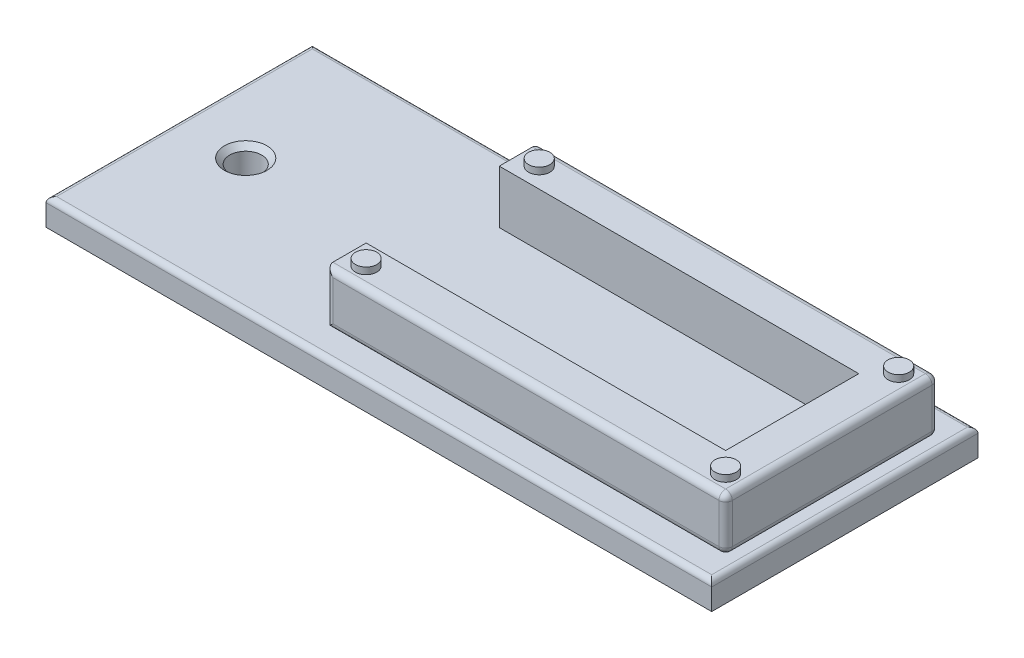
ISO-10303-21;
HEADER;
FILE_DESCRIPTION(('STEP AP214'),'2;1');
FILE_NAME('part.step','',(''),(''),'','','');
FILE_SCHEMA(('AUTOMOTIVE_DESIGN { 1 0 10303 214 1 1 1 1 }'));
ENDSEC;
DATA;
#1=APPLICATION_CONTEXT('core data for automotive mechanical design processes');
#2=APPLICATION_PROTOCOL_DEFINITION('international standard','automotive_design',2000,#1);
#3=PRODUCT_CONTEXT('',#1,'mechanical');
#4=PRODUCT('Part','Part','',(#3));
#5=PRODUCT_RELATED_PRODUCT_CATEGORY('part','',(#4));
#6=PRODUCT_DEFINITION_FORMATION('','',#4);
#7=PRODUCT_DEFINITION_CONTEXT('part definition',#1,'design');
#8=PRODUCT_DEFINITION('design','',#6,#7);
#9=PRODUCT_DEFINITION_SHAPE('','',#8);
#10=(LENGTH_UNIT() NAMED_UNIT(*) SI_UNIT(.MILLI.,.METRE.));
#11=(NAMED_UNIT(*) PLANE_ANGLE_UNIT() SI_UNIT($,.RADIAN.));
#12=(NAMED_UNIT(*) SI_UNIT($,.STERADIAN.) SOLID_ANGLE_UNIT());
#13=UNCERTAINTY_MEASURE_WITH_UNIT(LENGTH_MEASURE(1.E-05),#10,'distance_accuracy_value','');
#14=(GEOMETRIC_REPRESENTATION_CONTEXT(3) GLOBAL_UNCERTAINTY_ASSIGNED_CONTEXT((#13)) GLOBAL_UNIT_ASSIGNED_CONTEXT((#10,
#11,#12)) REPRESENTATION_CONTEXT('',''));
#15=CARTESIAN_POINT('',(0.,0.,0.));
#16=DIRECTION('',(0.,0.,1.));
#17=DIRECTION('',(1.,0.,0.));
#18=AXIS2_PLACEMENT_3D('',#15,#16,#17);
#19=CARTESIAN_POINT('',(69.7601340426178,108.703186723806,159.950463688265));
#20=DIRECTION('',(0.,1.,0.));
#21=DIRECTION('',(0.,0.,1.));
#22=AXIS2_PLACEMENT_3D('',#19,#20,#21);
#23=PLANE('',#22);
#24=DIRECTION('',(-1.,0.,0.));
#25=VECTOR('',#24,1.);
#26=CARTESIAN_POINT('',(-55.2398659573823,108.703186723806,111.950463688265));
#27=LINE('',#26,#25);
#28=CARTESIAN_POINT('',(192.760134042618,108.703186723806,111.950463688265));
#29=VERTEX_POINT('',#28);
#30=CARTESIAN_POINT('',(-53.2398659573823,108.703186723806,111.950463688265));
#31=VERTEX_POINT('',#30);
#32=EDGE_CURVE('E324',#29,#31,#27,.T.);
#33=ORIENTED_EDGE('',*,*,#32,.T.);
#34=DIRECTION('',(0.,0.,1.));
#35=VECTOR('',#34,1.);
#36=CARTESIAN_POINT('',(-53.2398659573823,108.703186723806,209.950463688265));
#37=LINE('',#36,#35);
#38=CARTESIAN_POINT('',(-53.2398659573823,108.703186723806,207.950463688265));
#39=VERTEX_POINT('',#38);
#40=EDGE_CURVE('E326',#31,#39,#37,.T.);
#41=ORIENTED_EDGE('',*,*,#40,.T.);
#42=DIRECTION('',(1.,0.,0.));
#43=VECTOR('',#42,1.);
#44=CARTESIAN_POINT('',(194.760134042618,108.703186723806,207.950463688265));
#45=LINE('',#44,#43);
#46=CARTESIAN_POINT('',(192.760134042618,108.703186723806,207.950463688265));
#47=VERTEX_POINT('',#46);
#48=EDGE_CURVE('E320',#39,#47,#45,.T.);
#49=ORIENTED_EDGE('',*,*,#48,.T.);
#50=DIRECTION('',(0.,0.,-1.));
#51=VECTOR('',#50,1.);
#52=CARTESIAN_POINT('',(192.760134042618,108.703186723806,109.950463688265));
#53=LINE('',#52,#51);
#54=EDGE_CURVE('E322',#47,#29,#53,.T.);
#55=ORIENTED_EDGE('',*,*,#54,.T.);
#56=EDGE_LOOP('',(#33,#41,#49,#55));
#57=FACE_BOUND('',#56,.T.);
#58=CARTESIAN_POINT('',(-30.2398659573823,108.703186723806,159.950463688265));
#59=DIRECTION('',(0.,1.,0.));
#60=DIRECTION('',(0.,0.,1.));
#61=AXIS2_PLACEMENT_3D('',#58,#59,#60);
#62=CIRCLE('',#61,8.00000000000001);
#63=CARTESIAN_POINT('',(-30.2398659573823,108.703186723806,167.950463688265));
#64=VERTEX_POINT('',#63);
#65=EDGE_CURVE('E11',#64,#64,#62,.F.);
#66=ORIENTED_EDGE('',*,*,#65,.T.);
#67=EDGE_LOOP('',(#66));
#68=FACE_BOUND('',#67,.T.);
#69=DIRECTION('',(0.,0.,-1.));
#70=VECTOR('',#69,1.);
#71=CARTESIAN_POINT('',(187.483980416502,108.703186723806,159.950463688265));
#72=LINE('',#71,#70);
#73=CARTESIAN_POINT('',(187.483980416502,108.703186723806,122.450463688265));
#74=VERTEX_POINT('',#73);
#75=CARTESIAN_POINT('',(187.483980416502,108.703186723806,197.450463688265));
#76=VERTEX_POINT('',#75);
#77=EDGE_CURVE('E224',#74,#76,#72,.F.);
#78=ORIENTED_EDGE('',*,*,#77,.T.);
#79=DIRECTION('',(1.,0.,0.));
#80=VECTOR('',#79,1.);
#81=CARTESIAN_POINT('',(174.983980416502,108.703186723806,197.450463688265));
#82=LINE('',#81,#80);
#83=CARTESIAN_POINT('',(39.9839804165022,108.703186723806,197.450463688265));
#84=VERTEX_POINT('',#83);
#85=EDGE_CURVE('E221',#76,#84,#82,.F.);
#86=ORIENTED_EDGE('',*,*,#85,.T.);
#87=DIRECTION('',(0.,0.,1.));
#88=VECTOR('',#87,1.);
#89=CARTESIAN_POINT('',(39.9839804165022,108.703186723806,184.950463688265));
#90=LINE('',#89,#88);
#91=CARTESIAN_POINT('',(39.9839804165022,108.703186723806,184.950463688265));
#92=VERTEX_POINT('',#91);
#93=EDGE_CURVE('E185',#92,#84,#90,.T.);
#94=ORIENTED_EDGE('',*,*,#93,.F.);
#95=DIRECTION('',(-1.,0.,0.));
#96=VECTOR('',#95,1.);
#97=CARTESIAN_POINT('',(174.983980416502,108.703186723806,184.950463688265));
#98=LINE('',#97,#96);
#99=CARTESIAN_POINT('',(174.983980416502,108.703186723806,184.950463688265));
#100=VERTEX_POINT('',#99);
#101=EDGE_CURVE('E834',#100,#92,#98,.T.);
#102=ORIENTED_EDGE('',*,*,#101,.F.);
#103=DIRECTION('',(0.,0.,1.));
#104=VECTOR('',#103,1.);
#105=CARTESIAN_POINT('',(174.983980416502,108.703186723806,184.950463688265));
#106=LINE('',#105,#104);
#107=CARTESIAN_POINT('',(174.983980416502,108.703186723806,134.950463688265));
#108=VERTEX_POINT('',#107);
#109=EDGE_CURVE('E832',#108,#100,#106,.T.);
#110=ORIENTED_EDGE('',*,*,#109,.F.);
#111=DIRECTION('',(1.,0.,0.));
#112=VECTOR('',#111,1.);
#113=CARTESIAN_POINT('',(174.983980416502,108.703186723806,134.950463688265));
#114=LINE('',#113,#112);
#115=CARTESIAN_POINT('',(39.9839804165022,108.703186723806,134.950463688265));
#116=VERTEX_POINT('',#115);
#117=EDGE_CURVE('E830',#116,#108,#114,.T.);
#118=ORIENTED_EDGE('',*,*,#117,.F.);
#119=DIRECTION('',(0.,0.,1.));
#120=VECTOR('',#119,1.);
#121=CARTESIAN_POINT('',(39.9839804165022,108.703186723806,134.950463688265));
#122=LINE('',#121,#120);
#123=CARTESIAN_POINT('',(39.9839804165022,108.703186723806,122.450463688265));
#124=VERTEX_POINT('',#123);
#125=EDGE_CURVE('E199',#124,#116,#122,.T.);
#126=ORIENTED_EDGE('',*,*,#125,.F.);
#127=DIRECTION('',(-1.,0.,0.));
#128=VECTOR('',#127,1.);
#129=CARTESIAN_POINT('',(174.983980416502,108.703186723806,122.450463688265));
#130=LINE('',#129,#128);
#131=EDGE_CURVE('E227',#124,#74,#130,.F.);
#132=ORIENTED_EDGE('',*,*,#131,.T.);
#133=EDGE_LOOP('',(#78,#86,#94,#102,#110,#118,#126,#132));
#134=FACE_BOUND('',#133,.T.);
#135=ADVANCED_FACE('F36',(#57,#68,#134),#23,.T.);
#136=CARTESIAN_POINT('',(-55.2398659573823,108.703186723806,209.950463688265));
#137=DIRECTION('',(1.,0.,0.));
#138=DIRECTION('',(0.,0.,-1.));
#139=AXIS2_PLACEMENT_3D('',#136,#137,#138);
#140=PLANE('',#139);
#141=DIRECTION('',(0.,-1.,0.));
#142=VECTOR('',#141,1.);
#143=CARTESIAN_POINT('',(-55.2398659573823,108.703186723806,209.950463688265));
#144=LINE('',#143,#142);
#145=CARTESIAN_POINT('',(-55.2398659573823,106.703186723806,209.950463688265));
#146=VERTEX_POINT('',#145);
#147=CARTESIAN_POINT('',(-55.2398659573823,98.7031867238057,209.950463688265));
#148=VERTEX_POINT('',#147);
#149=EDGE_CURVE('E318',#146,#148,#144,.T.);
#150=ORIENTED_EDGE('',*,*,#149,.F.);
#151=DIRECTION('',(0.,0.,1.));
#152=VECTOR('',#151,1.);
#153=CARTESIAN_POINT('',(-55.2398659573823,106.703186723806,109.950463688265));
#154=LINE('',#153,#152);
#155=CARTESIAN_POINT('',(-55.2398659573823,106.703186723806,109.950463688265));
#156=VERTEX_POINT('',#155);
#157=EDGE_CURVE('E329',#146,#156,#154,.F.);
#158=ORIENTED_EDGE('',*,*,#157,.T.);
#159=DIRECTION('',(0.,-1.,0.));
#160=VECTOR('',#159,1.);
#161=CARTESIAN_POINT('',(-55.2398659573823,108.703186723806,109.950463688265));
#162=LINE('',#161,#160);
#163=CARTESIAN_POINT('',(-55.2398659573823,98.7031867238057,109.950463688265));
#164=VERTEX_POINT('',#163);
#165=EDGE_CURVE('E312',#156,#164,#162,.T.);
#166=ORIENTED_EDGE('',*,*,#165,.T.);
#167=DIRECTION('',(0.,0.,1.));
#168=VECTOR('',#167,1.);
#169=CARTESIAN_POINT('',(-55.2398659573823,98.7031867238057,209.950463688265));
#170=LINE('',#169,#168);
#171=EDGE_CURVE('E299',#164,#148,#170,.T.);
#172=ORIENTED_EDGE('',*,*,#171,.T.);
#173=EDGE_LOOP('',(#150,#158,#166,#172));
#174=FACE_BOUND('',#173,.T.);
#175=ADVANCED_FACE('F363',(#174),#140,.F.);
#176=CARTESIAN_POINT('',(194.760134042618,108.703186723806,209.950463688265));
#177=DIRECTION('',(0.,0.,-1.));
#178=DIRECTION('',(-1.,0.,0.));
#179=AXIS2_PLACEMENT_3D('',#176,#177,#178);
#180=PLANE('',#179);
#181=DIRECTION('',(0.,-1.,0.));
#182=VECTOR('',#181,1.);
#183=CARTESIAN_POINT('',(194.760134042618,108.703186723806,209.950463688265));
#184=LINE('',#183,#182);
#185=CARTESIAN_POINT('',(194.760134042618,106.703186723806,209.950463688265));
#186=VERTEX_POINT('',#185);
#187=CARTESIAN_POINT('',(194.760134042618,98.7031867238057,209.950463688265));
#188=VERTEX_POINT('',#187);
#189=EDGE_CURVE('E316',#186,#188,#184,.T.);
#190=ORIENTED_EDGE('',*,*,#189,.F.);
#191=DIRECTION('',(1.,0.,0.));
#192=VECTOR('',#191,1.);
#193=CARTESIAN_POINT('',(-55.2398659573823,106.703186723806,209.950463688265));
#194=LINE('',#193,#192);
#195=EDGE_CURVE('E335',#186,#146,#194,.F.);
#196=ORIENTED_EDGE('',*,*,#195,.T.);
#197=ORIENTED_EDGE('',*,*,#149,.T.);
#198=DIRECTION('',(1.,0.,0.));
#199=VECTOR('',#198,1.);
#200=CARTESIAN_POINT('',(194.760134042618,98.7031867238057,209.950463688265));
#201=LINE('',#200,#199);
#202=EDGE_CURVE('E302',#148,#188,#201,.T.);
#203=ORIENTED_EDGE('',*,*,#202,.T.);
#204=EDGE_LOOP('',(#190,#196,#197,#203));
#205=FACE_BOUND('',#204,.T.);
#206=ADVANCED_FACE('F370',(#205),#180,.F.);
#207=CARTESIAN_POINT('',(194.760134042618,108.703186723806,209.950463688265));
#208=DIRECTION('',(-1.,0.,0.));
#209=DIRECTION('',(0.,0.,1.));
#210=AXIS2_PLACEMENT_3D('',#207,#208,#209);
#211=PLANE('',#210);
#212=DIRECTION('',(0.,-1.,0.));
#213=VECTOR('',#212,1.);
#214=CARTESIAN_POINT('',(194.760134042618,108.703186723806,109.950463688265));
#215=LINE('',#214,#213);
#216=CARTESIAN_POINT('',(194.760134042618,106.703186723806,109.950463688265));
#217=VERTEX_POINT('',#216);
#218=CARTESIAN_POINT('',(194.760134042618,98.7031867238057,109.950463688265));
#219=VERTEX_POINT('',#218);
#220=EDGE_CURVE('E314',#217,#219,#215,.T.);
#221=ORIENTED_EDGE('',*,*,#220,.F.);
#222=DIRECTION('',(0.,0.,-1.));
#223=VECTOR('',#222,1.);
#224=CARTESIAN_POINT('',(194.760134042618,106.703186723806,209.950463688265));
#225=LINE('',#224,#223);
#226=EDGE_CURVE('E59',#217,#186,#225,.F.);
#227=ORIENTED_EDGE('',*,*,#226,.T.);
#228=ORIENTED_EDGE('',*,*,#189,.T.);
#229=DIRECTION('',(0.,0.,-1.));
#230=VECTOR('',#229,1.);
#231=CARTESIAN_POINT('',(194.760134042618,98.7031867238057,209.950463688265));
#232=LINE('',#231,#230);
#233=EDGE_CURVE('E306',#188,#219,#232,.T.);
#234=ORIENTED_EDGE('',*,*,#233,.T.);
#235=EDGE_LOOP('',(#221,#227,#228,#234));
#236=FACE_BOUND('',#235,.T.);
#237=ADVANCED_FACE('F384',(#236),#211,.F.);
#238=CARTESIAN_POINT('',(194.760134042618,108.703186723806,109.950463688265));
#239=DIRECTION('',(0.,0.,1.));
#240=DIRECTION('',(1.,0.,0.));
#241=AXIS2_PLACEMENT_3D('',#238,#239,#240);
#242=PLANE('',#241);
#243=ORIENTED_EDGE('',*,*,#165,.F.);
#244=DIRECTION('',(-1.,0.,0.));
#245=VECTOR('',#244,1.);
#246=CARTESIAN_POINT('',(194.760134042618,106.703186723806,109.950463688265));
#247=LINE('',#246,#245);
#248=EDGE_CURVE('E332',#156,#217,#247,.F.);
#249=ORIENTED_EDGE('',*,*,#248,.T.);
#250=ORIENTED_EDGE('',*,*,#220,.T.);
#251=DIRECTION('',(-1.,0.,0.));
#252=VECTOR('',#251,1.);
#253=CARTESIAN_POINT('',(194.760134042618,98.7031867238057,109.950463688265));
#254=LINE('',#253,#252);
#255=EDGE_CURVE('E309',#219,#164,#254,.T.);
#256=ORIENTED_EDGE('',*,*,#255,.T.);
#257=EDGE_LOOP('',(#243,#249,#250,#256));
#258=FACE_BOUND('',#257,.T.);
#259=ADVANCED_FACE('F380',(#258),#242,.F.);
#260=CARTESIAN_POINT('',(69.7601340426178,98.7031867238057,159.950463688265));
#261=DIRECTION('',(0.,1.,0.));
#262=DIRECTION('',(0.,0.,1.));
#263=AXIS2_PLACEMENT_3D('',#260,#261,#262);
#264=PLANE('',#263);
#265=CARTESIAN_POINT('',(-30.2398659573823,98.7031867238057,159.950463688265));
#266=DIRECTION('',(0.,1.,0.));
#267=DIRECTION('',(0.,0.,1.));
#268=AXIS2_PLACEMENT_3D('',#265,#266,#267);
#269=CIRCLE('',#268,6.);
#270=CARTESIAN_POINT('',(-30.2398659573823,98.7031867238057,165.950463688265));
#271=VERTEX_POINT('',#270);
#272=EDGE_CURVE('E250',#271,#271,#269,.T.);
#273=ORIENTED_EDGE('',*,*,#272,.T.);
#274=EDGE_LOOP('',(#273));
#275=FACE_BOUND('',#274,.T.);
#276=ORIENTED_EDGE('',*,*,#171,.F.);
#277=ORIENTED_EDGE('',*,*,#255,.F.);
#278=ORIENTED_EDGE('',*,*,#233,.F.);
#279=ORIENTED_EDGE('',*,*,#202,.F.);
#280=EDGE_LOOP('',(#276,#277,#278,#279));
#281=FACE_BOUND('',#280,.T.);
#282=ADVANCED_FACE('F376',(#275,#281),#264,.F.);
#283=CARTESIAN_POINT('',(192.760134042618,106.703186723806,159.950463688265));
#284=DIRECTION('',(0.,0.,1.));
#285=DIRECTION('',(1.,0.,0.));
#286=AXIS2_PLACEMENT_3D('',#283,#284,#285);
#287=CYLINDRICAL_SURFACE('',#286,2.);
#288=CARTESIAN_POINT('',(192.760134042618,106.703186723806,207.950463688265));
#289=DIRECTION('',(-0.707106781186547,0.,0.707106781186547));
#290=DIRECTION('',(-0.707106781186547,0.,-0.707106781186547));
#291=AXIS2_PLACEMENT_3D('',#288,#289,#290);
#292=ELLIPSE('',#291,2.82842712474619,2.);
#293=EDGE_CURVE('E340',#186,#47,#292,.T.);
#294=ORIENTED_EDGE('',*,*,#293,.F.);
#295=ORIENTED_EDGE('',*,*,#226,.F.);
#296=CARTESIAN_POINT('',(192.760134042618,106.703186723806,111.950463688265));
#297=DIRECTION('',(0.707106781186547,0.,0.707106781186547));
#298=DIRECTION('',(-0.707106781186547,0.,0.707106781186547));
#299=AXIS2_PLACEMENT_3D('',#296,#297,#298);
#300=ELLIPSE('',#299,2.82842712474619,2.);
#301=EDGE_CURVE('E303',#29,#217,#300,.F.);
#302=ORIENTED_EDGE('',*,*,#301,.F.);
#303=ORIENTED_EDGE('',*,*,#54,.F.);
#304=EDGE_LOOP('',(#294,#295,#302,#303));
#305=FACE_BOUND('',#304,.T.);
#306=ADVANCED_FACE('F379',(#305),#287,.T.);
#307=CARTESIAN_POINT('',(69.7601340426178,106.703186723806,111.950463688265));
#308=DIRECTION('',(1.,0.,0.));
#309=DIRECTION('',(0.,0.,-1.));
#310=AXIS2_PLACEMENT_3D('',#307,#308,#309);
#311=CYLINDRICAL_SURFACE('',#310,2.);
#312=ORIENTED_EDGE('',*,*,#301,.T.);
#313=ORIENTED_EDGE('',*,*,#248,.F.);
#314=CARTESIAN_POINT('',(-53.2398659573823,106.703186723806,111.950463688265));
#315=DIRECTION('',(0.707106781186547,0.,-0.707106781186547));
#316=DIRECTION('',(0.707106781186547,0.,0.707106781186547));
#317=AXIS2_PLACEMENT_3D('',#314,#315,#316);
#318=ELLIPSE('',#317,2.82842712474619,2.);
#319=EDGE_CURVE('E338',#31,#156,#318,.F.);
#320=ORIENTED_EDGE('',*,*,#319,.F.);
#321=ORIENTED_EDGE('',*,*,#32,.F.);
#322=EDGE_LOOP('',(#312,#313,#320,#321));
#323=FACE_BOUND('',#322,.T.);
#324=ADVANCED_FACE('F397',(#323),#311,.T.);
#325=CARTESIAN_POINT('',(69.7601340426178,106.703186723806,207.950463688265));
#326=DIRECTION('',(-1.,0.,0.));
#327=DIRECTION('',(0.,0.,1.));
#328=AXIS2_PLACEMENT_3D('',#325,#326,#327);
#329=CYLINDRICAL_SURFACE('',#328,2.);
#330=ORIENTED_EDGE('',*,*,#293,.T.);
#331=ORIENTED_EDGE('',*,*,#48,.F.);
#332=CARTESIAN_POINT('',(-53.2398659573823,106.703186723806,207.950463688265));
#333=DIRECTION('',(-0.707106781186547,0.,-0.707106781186547));
#334=DIRECTION('',(-0.707106781186547,0.,0.707106781186547));
#335=AXIS2_PLACEMENT_3D('',#332,#333,#334);
#336=ELLIPSE('',#335,2.82842712474619,2.);
#337=EDGE_CURVE('E298',#146,#39,#336,.T.);
#338=ORIENTED_EDGE('',*,*,#337,.F.);
#339=ORIENTED_EDGE('',*,*,#195,.F.);
#340=EDGE_LOOP('',(#330,#331,#338,#339));
#341=FACE_BOUND('',#340,.T.);
#342=ADVANCED_FACE('F393',(#341),#329,.T.);
#343=CARTESIAN_POINT('',(-53.2398659573823,106.703186723806,159.950463688265));
#344=DIRECTION('',(0.,0.,-1.));
#345=DIRECTION('',(-1.,0.,0.));
#346=AXIS2_PLACEMENT_3D('',#343,#344,#345);
#347=CYLINDRICAL_SURFACE('',#346,2.);
#348=ORIENTED_EDGE('',*,*,#319,.T.);
#349=ORIENTED_EDGE('',*,*,#157,.F.);
#350=ORIENTED_EDGE('',*,*,#337,.T.);
#351=ORIENTED_EDGE('',*,*,#40,.F.);
#352=EDGE_LOOP('',(#348,#349,#350,#351));
#353=FACE_BOUND('',#352,.T.);
#354=ADVANCED_FACE('F359',(#353),#347,.T.);
#355=CARTESIAN_POINT('',(-30.2398659573823,98.7031867238057,159.950463688265));
#356=DIRECTION('',(0.,1.,0.));
#357=DIRECTION('',(0.,0.,1.));
#358=AXIS2_PLACEMENT_3D('',#355,#356,#357);
#359=CYLINDRICAL_SURFACE('',#358,6.);
#360=CARTESIAN_POINT('',(-30.2398659573823,106.703186723806,159.950463688265));
#361=DIRECTION('',(0.,1.,0.));
#362=DIRECTION('',(0.,0.,1.));
#363=AXIS2_PLACEMENT_3D('',#360,#361,#362);
#364=CIRCLE('',#363,6.);
#365=CARTESIAN_POINT('',(-30.2398659573823,106.703186723806,165.950463688265));
#366=VERTEX_POINT('',#365);
#367=EDGE_CURVE('E44',#366,#366,#364,.T.);
#368=ORIENTED_EDGE('',*,*,#367,.T.);
#369=EDGE_LOOP('',(#368));
#370=FACE_BOUND('',#369,.T.);
#371=ORIENTED_EDGE('',*,*,#272,.F.);
#372=EDGE_LOOP('',(#371));
#373=FACE_BOUND('',#372,.T.);
#374=ADVANCED_FACE('F347',(#370,#373),#359,.F.);
#375=CARTESIAN_POINT('',(-30.2398659573823,106.703186723806,159.950463688265));
#376=DIRECTION('',(0.,1.,0.));
#377=DIRECTION('',(0.,0.,1.));
#378=AXIS2_PLACEMENT_3D('',#375,#376,#377);
#379=CONICAL_SURFACE('',#378,6.,0.785398163397443);
#380=ORIENTED_EDGE('',*,*,#65,.F.);
#381=EDGE_LOOP('',(#380));
#382=FACE_BOUND('',#381,.T.);
#383=ORIENTED_EDGE('',*,*,#367,.F.);
#384=EDGE_LOOP('',(#383));
#385=FACE_BOUND('',#384,.T.);
#386=ADVANCED_FACE('F38',(#382,#385),#379,.F.);
#387=CARTESIAN_POINT('',(174.983980416502,128.703186723806,159.950463688265));
#388=DIRECTION('',(0.,1.,0.));
#389=DIRECTION('',(0.,0.,1.));
#390=AXIS2_PLACEMENT_3D('',#387,#388,#389);
#391=PLANE('',#390);
#392=CARTESIAN_POINT('',(182.483980416502,128.703186723806,127.450463688265));
#393=DIRECTION('',(0.,1.,0.));
#394=DIRECTION('',(0.52761845953361,0.,0.849481466048189));
#395=AXIS2_PLACEMENT_3D('',#392,#393,#394);
#396=CIRCLE('',#395,4.);
#397=CARTESIAN_POINT('',(184.594454254637,128.703186723806,130.848389552458));
#398=VERTEX_POINT('',#397);
#399=EDGE_CURVE('E801',#398,#398,#396,.T.);
#400=ORIENTED_EDGE('',*,*,#399,.F.);
#401=EDGE_LOOP('',(#400));
#402=FACE_BOUND('',#401,.T.);
#403=CARTESIAN_POINT('',(47.4839804165023,128.703186723806,192.450463688265));
#404=DIRECTION('',(0.,1.,0.));
#405=DIRECTION('',(0.,0.,1.));
#406=AXIS2_PLACEMENT_3D('',#403,#404,#405);
#407=CIRCLE('',#406,4.);
#408=CARTESIAN_POINT('',(47.4839804165023,128.703186723806,196.450463688265));
#409=VERTEX_POINT('',#408);
#410=EDGE_CURVE('E816',#409,#409,#407,.T.);
#411=ORIENTED_EDGE('',*,*,#410,.F.);
#412=EDGE_LOOP('',(#411));
#413=FACE_BOUND('',#412,.T.);
#414=DIRECTION('',(0.,0.,-1.));
#415=VECTOR('',#414,1.);
#416=CARTESIAN_POINT('',(187.483980416502,128.703186723806,119.950463688265));
#417=LINE('',#416,#415);
#418=CARTESIAN_POINT('',(187.483980416502,128.703186723806,197.450463688265));
#419=VERTEX_POINT('',#418);
#420=CARTESIAN_POINT('',(187.483980416502,128.703186723806,122.450463688265));
#421=VERTEX_POINT('',#420);
#422=EDGE_CURVE('E202',#419,#421,#417,.T.);
#423=ORIENTED_EDGE('',*,*,#422,.T.);
#424=DIRECTION('',(-1.,0.,0.));
#425=VECTOR('',#424,1.);
#426=CARTESIAN_POINT('',(39.9839804165022,128.703186723806,122.450463688265));
#427=LINE('',#426,#425);
#428=CARTESIAN_POINT('',(39.9839804165022,128.703186723806,122.450463688265));
#429=VERTEX_POINT('',#428);
#430=EDGE_CURVE('E182',#421,#429,#427,.T.);
#431=ORIENTED_EDGE('',*,*,#430,.T.);
#432=DIRECTION('',(0.,0.,1.));
#433=VECTOR('',#432,1.);
#434=CARTESIAN_POINT('',(39.9839804165022,128.703186723806,134.950463688265));
#435=LINE('',#434,#433);
#436=CARTESIAN_POINT('',(39.9839804165022,128.703186723806,134.950463688265));
#437=VERTEX_POINT('',#436);
#438=EDGE_CURVE('E175',#429,#437,#435,.T.);
#439=ORIENTED_EDGE('',*,*,#438,.T.);
#440=DIRECTION('',(1.,0.,0.));
#441=VECTOR('',#440,1.);
#442=CARTESIAN_POINT('',(174.983980416502,128.703186723806,134.950463688265));
#443=LINE('',#442,#441);
#444=CARTESIAN_POINT('',(174.983980416502,128.703186723806,134.950463688265));
#445=VERTEX_POINT('',#444);
#446=EDGE_CURVE('E179',#437,#445,#443,.T.);
#447=ORIENTED_EDGE('',*,*,#446,.T.);
#448=DIRECTION('',(0.,0.,1.));
#449=VECTOR('',#448,1.);
#450=CARTESIAN_POINT('',(174.983980416502,128.703186723806,184.950463688265));
#451=LINE('',#450,#449);
#452=CARTESIAN_POINT('',(174.983980416502,128.703186723806,184.950463688265));
#453=VERTEX_POINT('',#452);
#454=EDGE_CURVE('E195',#445,#453,#451,.T.);
#455=ORIENTED_EDGE('',*,*,#454,.T.);
#456=DIRECTION('',(-1.,0.,0.));
#457=VECTOR('',#456,1.);
#458=CARTESIAN_POINT('',(174.983980416502,128.703186723806,184.950463688265));
#459=LINE('',#458,#457);
#460=CARTESIAN_POINT('',(39.9839804165022,128.703186723806,184.950463688265));
#461=VERTEX_POINT('',#460);
#462=EDGE_CURVE('E824',#453,#461,#459,.T.);
#463=ORIENTED_EDGE('',*,*,#462,.T.);
#464=DIRECTION('',(0.,0.,1.));
#465=VECTOR('',#464,1.);
#466=CARTESIAN_POINT('',(39.9839804165022,128.703186723806,184.950463688265));
#467=LINE('',#466,#465);
#468=CARTESIAN_POINT('',(39.9839804165022,128.703186723806,197.450463688265));
#469=VERTEX_POINT('',#468);
#470=EDGE_CURVE('E826',#461,#469,#467,.T.);
#471=ORIENTED_EDGE('',*,*,#470,.T.);
#472=DIRECTION('',(1.,0.,0.));
#473=VECTOR('',#472,1.);
#474=CARTESIAN_POINT('',(189.983980416502,128.703186723806,197.450463688265));
#475=LINE('',#474,#473);
#476=EDGE_CURVE('E200',#469,#419,#475,.T.);
#477=ORIENTED_EDGE('',*,*,#476,.T.);
#478=EDGE_LOOP('',(#423,#431,#439,#447,#455,#463,#471,#477));
#479=FACE_BOUND('',#478,.T.);
#480=CARTESIAN_POINT('',(47.4839804165023,128.703186723806,127.450463688265));
#481=DIRECTION('',(0.,1.,0.));
#482=DIRECTION('',(0.,0.,1.));
#483=AXIS2_PLACEMENT_3D('',#480,#481,#482);
#484=CIRCLE('',#483,4.);
#485=CARTESIAN_POINT('',(47.4839804165023,128.703186723806,131.450463688265));
#486=VERTEX_POINT('',#485);
#487=EDGE_CURVE('E811',#486,#486,#484,.T.);
#488=ORIENTED_EDGE('',*,*,#487,.F.);
#489=EDGE_LOOP('',(#488));
#490=FACE_BOUND('',#489,.T.);
#491=CARTESIAN_POINT('',(182.483980416502,128.703186723806,192.450463688265));
#492=DIRECTION('',(0.,1.,0.));
#493=DIRECTION('',(0.476083240209916,0.,0.87940022082737));
#494=AXIS2_PLACEMENT_3D('',#491,#492,#493);
#495=CIRCLE('',#494,4.);
#496=CARTESIAN_POINT('',(184.388313377342,128.703186723806,195.968064571574));
#497=VERTEX_POINT('',#496);
#498=EDGE_CURVE('E802',#497,#497,#495,.T.);
#499=ORIENTED_EDGE('',*,*,#498,.F.);
#500=EDGE_LOOP('',(#499));
#501=FACE_BOUND('',#500,.T.);
#502=ADVANCED_FACE('F177',(#402,#413,#479,#490,#501),#391,.T.);
#503=CARTESIAN_POINT('',(39.9839804165022,128.703186723806,134.950463688265));
#504=DIRECTION('',(1.,0.,0.));
#505=DIRECTION('',(0.,0.,-1.));
#506=AXIS2_PLACEMENT_3D('',#503,#504,#505);
#507=PLANE('',#506);
#508=ORIENTED_EDGE('',*,*,#438,.F.);
#509=DIRECTION('',(0.,-1.,0.));
#510=VECTOR('',#509,1.);
#511=CARTESIAN_POINT('',(39.9839804165022,128.703186723806,122.450463688265));
#512=LINE('',#511,#510);
#513=EDGE_CURVE('E219',#429,#124,#512,.T.);
#514=ORIENTED_EDGE('',*,*,#513,.T.);
#515=ORIENTED_EDGE('',*,*,#125,.T.);
#516=DIRECTION('',(0.,-1.,0.));
#517=VECTOR('',#516,1.);
#518=CARTESIAN_POINT('',(39.9839804165022,128.703186723806,134.950463688265));
#519=LINE('',#518,#517);
#520=EDGE_CURVE('E190',#437,#116,#519,.T.);
#521=ORIENTED_EDGE('',*,*,#520,.F.);
#522=EDGE_LOOP('',(#508,#514,#515,#521));
#523=FACE_BOUND('',#522,.T.);
#524=ADVANCED_FACE('F197',(#523),#507,.F.);
#525=CARTESIAN_POINT('',(174.983980416502,128.703186723806,134.950463688265));
#526=DIRECTION('',(0.,0.,-1.));
#527=DIRECTION('',(-1.,0.,0.));
#528=AXIS2_PLACEMENT_3D('',#525,#526,#527);
#529=PLANE('',#528);
#530=ORIENTED_EDGE('',*,*,#117,.T.);
#531=DIRECTION('',(0.,-1.,0.));
#532=VECTOR('',#531,1.);
#533=CARTESIAN_POINT('',(174.983980416502,128.703186723806,134.950463688265));
#534=LINE('',#533,#532);
#535=EDGE_CURVE('E193',#445,#108,#534,.T.);
#536=ORIENTED_EDGE('',*,*,#535,.F.);
#537=ORIENTED_EDGE('',*,*,#446,.F.);
#538=ORIENTED_EDGE('',*,*,#520,.T.);
#539=EDGE_LOOP('',(#530,#536,#537,#538));
#540=FACE_BOUND('',#539,.T.);
#541=ADVANCED_FACE('F189',(#540),#529,.F.);
#542=CARTESIAN_POINT('',(174.983980416502,128.703186723806,184.950463688265));
#543=DIRECTION('',(1.,0.,0.));
#544=DIRECTION('',(0.,0.,-1.));
#545=AXIS2_PLACEMENT_3D('',#542,#543,#544);
#546=PLANE('',#545);
#547=ORIENTED_EDGE('',*,*,#109,.T.);
#548=DIRECTION('',(0.,-1.,0.));
#549=VECTOR('',#548,1.);
#550=CARTESIAN_POINT('',(174.983980416502,128.703186723806,184.950463688265));
#551=LINE('',#550,#549);
#552=EDGE_CURVE('E204',#453,#100,#551,.T.);
#553=ORIENTED_EDGE('',*,*,#552,.F.);
#554=ORIENTED_EDGE('',*,*,#454,.F.);
#555=ORIENTED_EDGE('',*,*,#535,.T.);
#556=EDGE_LOOP('',(#547,#553,#554,#555));
#557=FACE_BOUND('',#556,.T.);
#558=ADVANCED_FACE('F512',(#557),#546,.F.);
#559=CARTESIAN_POINT('',(174.983980416502,128.703186723806,184.950463688265));
#560=DIRECTION('',(0.,0.,1.));
#561=DIRECTION('',(1.,0.,0.));
#562=AXIS2_PLACEMENT_3D('',#559,#560,#561);
#563=PLANE('',#562);
#564=ORIENTED_EDGE('',*,*,#101,.T.);
#565=DIRECTION('',(0.,-1.,0.));
#566=VECTOR('',#565,1.);
#567=CARTESIAN_POINT('',(39.9839804165022,128.703186723806,184.950463688265));
#568=LINE('',#567,#566);
#569=EDGE_CURVE('E51',#461,#92,#568,.T.);
#570=ORIENTED_EDGE('',*,*,#569,.F.);
#571=ORIENTED_EDGE('',*,*,#462,.F.);
#572=ORIENTED_EDGE('',*,*,#552,.T.);
#573=EDGE_LOOP('',(#564,#570,#571,#572));
#574=FACE_BOUND('',#573,.T.);
#575=ADVANCED_FACE('F519',(#574),#563,.F.);
#576=CARTESIAN_POINT('',(39.9839804165022,128.703186723806,184.950463688265));
#577=DIRECTION('',(1.,0.,0.));
#578=DIRECTION('',(0.,0.,-1.));
#579=AXIS2_PLACEMENT_3D('',#576,#577,#578);
#580=PLANE('',#579);
#581=ORIENTED_EDGE('',*,*,#93,.T.);
#582=DIRECTION('',(0.,-1.,0.));
#583=VECTOR('',#582,1.);
#584=CARTESIAN_POINT('',(39.9839804165022,128.703186723806,197.450463688265));
#585=LINE('',#584,#583);
#586=EDGE_CURVE('E248',#84,#469,#585,.F.);
#587=ORIENTED_EDGE('',*,*,#586,.T.);
#588=ORIENTED_EDGE('',*,*,#470,.F.);
#589=ORIENTED_EDGE('',*,*,#569,.T.);
#590=EDGE_LOOP('',(#581,#587,#588,#589));
#591=FACE_BOUND('',#590,.T.);
#592=ADVANCED_FACE('F527',(#591),#580,.F.);
#593=CARTESIAN_POINT('',(189.983980416502,128.703186723806,199.950463688265));
#594=DIRECTION('',(0.,0.,-1.));
#595=DIRECTION('',(-1.,0.,0.));
#596=AXIS2_PLACEMENT_3D('',#593,#594,#595);
#597=PLANE('',#596);
#598=DIRECTION('',(1.,0.,0.));
#599=VECTOR('',#598,1.);
#600=CARTESIAN_POINT('',(39.9839804165022,126.203186723806,199.950463688265));
#601=LINE('',#600,#599);
#602=CARTESIAN_POINT('',(187.483980416502,126.203186723806,199.950463688265));
#603=VERTEX_POINT('',#602);
#604=CARTESIAN_POINT('',(42.4839804165023,126.203186723806,199.950463688265));
#605=VERTEX_POINT('',#604);
#606=EDGE_CURVE('E243',#603,#605,#601,.F.);
#607=ORIENTED_EDGE('',*,*,#606,.T.);
#608=DIRECTION('',(0.,-1.,0.));
#609=VECTOR('',#608,1.);
#610=CARTESIAN_POINT('',(42.4839804165023,128.703186723806,199.950463688265));
#611=LINE('',#610,#609);
#612=CARTESIAN_POINT('',(42.4839804165023,111.203186723806,199.950463688265));
#613=VERTEX_POINT('',#612);
#614=EDGE_CURVE('E245',#605,#613,#611,.T.);
#615=ORIENTED_EDGE('',*,*,#614,.T.);
#616=DIRECTION('',(1.,0.,0.));
#617=VECTOR('',#616,1.);
#618=CARTESIAN_POINT('',(189.983980416502,111.203186723806,199.950463688265));
#619=LINE('',#618,#617);
#620=CARTESIAN_POINT('',(187.483980416502,111.203186723806,199.950463688265));
#621=VERTEX_POINT('',#620);
#622=EDGE_CURVE('E239',#613,#621,#619,.T.);
#623=ORIENTED_EDGE('',*,*,#622,.T.);
#624=DIRECTION('',(0.,-1.,0.));
#625=VECTOR('',#624,1.);
#626=CARTESIAN_POINT('',(187.483980416502,128.703186723806,199.950463688265));
#627=LINE('',#626,#625);
#628=EDGE_CURVE('E241',#621,#603,#627,.F.);
#629=ORIENTED_EDGE('',*,*,#628,.T.);
#630=EDGE_LOOP('',(#607,#615,#623,#629));
#631=FACE_BOUND('',#630,.T.);
#632=ADVANCED_FACE('F535',(#631),#597,.F.);
#633=CARTESIAN_POINT('',(189.983980416502,128.703186723806,199.950463688265));
#634=DIRECTION('',(-1.,0.,0.));
#635=DIRECTION('',(0.,0.,1.));
#636=AXIS2_PLACEMENT_3D('',#633,#634,#635);
#637=PLANE('',#636);
#638=DIRECTION('',(0.,-1.,0.));
#639=VECTOR('',#638,1.);
#640=CARTESIAN_POINT('',(189.983980416502,128.703186723806,122.450463688265));
#641=LINE('',#640,#639);
#642=CARTESIAN_POINT('',(189.983980416502,111.203186723806,122.450463688265));
#643=VERTEX_POINT('',#642);
#644=CARTESIAN_POINT('',(189.983980416502,126.203186723806,122.450463688265));
#645=VERTEX_POINT('',#644);
#646=EDGE_CURVE('E234',#643,#645,#641,.F.);
#647=ORIENTED_EDGE('',*,*,#646,.T.);
#648=DIRECTION('',(0.,0.,-1.));
#649=VECTOR('',#648,1.);
#650=CARTESIAN_POINT('',(189.983980416502,126.203186723806,199.950463688265));
#651=LINE('',#650,#649);
#652=CARTESIAN_POINT('',(189.983980416502,126.203186723806,197.450463688265));
#653=VERTEX_POINT('',#652);
#654=EDGE_CURVE('E236',#645,#653,#651,.F.);
#655=ORIENTED_EDGE('',*,*,#654,.T.);
#656=DIRECTION('',(0.,-1.,0.));
#657=VECTOR('',#656,1.);
#658=CARTESIAN_POINT('',(189.983980416502,128.703186723806,197.450463688265));
#659=LINE('',#658,#657);
#660=CARTESIAN_POINT('',(189.983980416502,111.203186723806,197.450463688265));
#661=VERTEX_POINT('',#660);
#662=EDGE_CURVE('E230',#653,#661,#659,.T.);
#663=ORIENTED_EDGE('',*,*,#662,.T.);
#664=DIRECTION('',(0.,0.,-1.));
#665=VECTOR('',#664,1.);
#666=CARTESIAN_POINT('',(189.983980416502,111.203186723806,199.950463688265));
#667=LINE('',#666,#665);
#668=EDGE_CURVE('E232',#661,#643,#667,.T.);
#669=ORIENTED_EDGE('',*,*,#668,.T.);
#670=EDGE_LOOP('',(#647,#655,#663,#669));
#671=FACE_BOUND('',#670,.T.);
#672=ADVANCED_FACE('F542',(#671),#637,.F.);
#673=CARTESIAN_POINT('',(189.983980416502,128.703186723806,119.950463688265));
#674=DIRECTION('',(0.,0.,1.));
#675=DIRECTION('',(1.,0.,0.));
#676=AXIS2_PLACEMENT_3D('',#673,#674,#675);
#677=PLANE('',#676);
#678=DIRECTION('',(0.,-1.,0.));
#679=VECTOR('',#678,1.);
#680=CARTESIAN_POINT('',(42.4839804165023,128.703186723806,119.950463688265));
#681=LINE('',#680,#679);
#682=CARTESIAN_POINT('',(42.4839804165023,111.203186723806,119.950463688265));
#683=VERTEX_POINT('',#682);
#684=CARTESIAN_POINT('',(42.4839804165023,126.203186723806,119.950463688265));
#685=VERTEX_POINT('',#684);
#686=EDGE_CURVE('E214',#683,#685,#681,.F.);
#687=ORIENTED_EDGE('',*,*,#686,.T.);
#688=DIRECTION('',(-1.,0.,0.));
#689=VECTOR('',#688,1.);
#690=CARTESIAN_POINT('',(189.983980416502,126.203186723806,119.950463688265));
#691=LINE('',#690,#689);
#692=CARTESIAN_POINT('',(187.483980416502,126.203186723806,119.950463688265));
#693=VERTEX_POINT('',#692);
#694=EDGE_CURVE('E216',#685,#693,#691,.F.);
#695=ORIENTED_EDGE('',*,*,#694,.T.);
#696=DIRECTION('',(0.,-1.,0.));
#697=VECTOR('',#696,1.);
#698=CARTESIAN_POINT('',(187.483980416502,128.703186723806,119.950463688265));
#699=LINE('',#698,#697);
#700=CARTESIAN_POINT('',(187.483980416502,111.203186723806,119.950463688265));
#701=VERTEX_POINT('',#700);
#702=EDGE_CURVE('E210',#693,#701,#699,.T.);
#703=ORIENTED_EDGE('',*,*,#702,.T.);
#704=DIRECTION('',(-1.,0.,0.));
#705=VECTOR('',#704,1.);
#706=CARTESIAN_POINT('',(189.983980416502,111.203186723806,119.950463688265));
#707=LINE('',#706,#705);
#708=EDGE_CURVE('E212',#701,#683,#707,.T.);
#709=ORIENTED_EDGE('',*,*,#708,.T.);
#710=EDGE_LOOP('',(#687,#695,#703,#709));
#711=FACE_BOUND('',#710,.T.);
#712=ADVANCED_FACE('F550',(#711),#677,.F.);
#713=CARTESIAN_POINT('',(189.983980416502,111.203186723806,197.450463688265));
#714=DIRECTION('',(1.,0.,0.));
#715=DIRECTION('',(0.,0.,-1.));
#716=AXIS2_PLACEMENT_3D('',#713,#714,#715);
#717=CYLINDRICAL_SURFACE('',#716,2.5);
#718=CARTESIAN_POINT('',(187.483980416502,111.203186723806,197.450463688265));
#719=DIRECTION('',(1.,0.,0.));
#720=DIRECTION('',(0.,0.,-1.));
#721=AXIS2_PLACEMENT_3D('',#718,#719,#720);
#722=CIRCLE('',#721,2.5);
#723=EDGE_CURVE('E291',#621,#76,#722,.T.);
#724=ORIENTED_EDGE('',*,*,#723,.F.);
#725=ORIENTED_EDGE('',*,*,#622,.F.);
#726=CARTESIAN_POINT('',(42.4839804165023,111.203186723806,197.450463688265));
#727=DIRECTION('',(0.707106781186547,-0.707106781186547,0.));
#728=DIRECTION('',(0.707106781186547,0.707106781186547,0.));
#729=AXIS2_PLACEMENT_3D('',#726,#727,#728);
#730=ELLIPSE('',#729,3.53553390593274,2.5);
#731=EDGE_CURVE('E294',#84,#613,#730,.F.);
#732=ORIENTED_EDGE('',*,*,#731,.F.);
#733=ORIENTED_EDGE('',*,*,#85,.F.);
#734=EDGE_LOOP('',(#724,#725,#732,#733));
#735=FACE_BOUND('',#734,.T.);
#736=ADVANCED_FACE('F558',(#735),#717,.T.);
#737=CARTESIAN_POINT('',(42.4839804165023,128.703186723806,197.450463688265));
#738=DIRECTION('',(0.,-1.,0.));
#739=DIRECTION('',(0.,0.,-1.));
#740=AXIS2_PLACEMENT_3D('',#737,#738,#739);
#741=CYLINDRICAL_SURFACE('',#740,2.5);
#742=ORIENTED_EDGE('',*,*,#731,.T.);
#743=ORIENTED_EDGE('',*,*,#614,.F.);
#744=CARTESIAN_POINT('',(42.4839804165023,126.203186723806,197.450463688265));
#745=DIRECTION('',(-0.707106781186547,-0.707106781186547,0.));
#746=DIRECTION('',(-0.707106781186547,0.707106781186547,0.));
#747=AXIS2_PLACEMENT_3D('',#744,#745,#746);
#748=ELLIPSE('',#747,3.53553390593274,2.5);
#749=EDGE_CURVE('E285',#469,#605,#748,.F.);
#750=ORIENTED_EDGE('',*,*,#749,.F.);
#751=ORIENTED_EDGE('',*,*,#586,.F.);
#752=EDGE_LOOP('',(#742,#743,#750,#751));
#753=FACE_BOUND('',#752,.T.);
#754=ADVANCED_FACE('F566',(#753),#741,.T.);
#755=CARTESIAN_POINT('',(187.483980416502,111.203186723806,197.450463688265));
#756=DIRECTION('',(0.,0.,1.));
#757=DIRECTION('',(1.,0.,0.));
#758=AXIS2_PLACEMENT_3D('',#755,#756,#757);
#759=SPHERICAL_SURFACE('',#758,2.5);
#760=CARTESIAN_POINT('',(187.483980416502,111.203186723806,197.450463688265));
#761=DIRECTION('',(0.,0.,1.));
#762=DIRECTION('',(1.,0.,0.));
#763=AXIS2_PLACEMENT_3D('',#760,#761,#762);
#764=CIRCLE('',#763,2.5);
#765=EDGE_CURVE('E282',#661,#76,#764,.F.);
#766=ORIENTED_EDGE('',*,*,#765,.F.);
#767=CARTESIAN_POINT('',(187.483980416502,111.203186723806,197.450463688265));
#768=DIRECTION('',(0.,-1.,0.));
#769=DIRECTION('',(0.,0.,-1.));
#770=AXIS2_PLACEMENT_3D('',#767,#768,#769);
#771=CIRCLE('',#770,2.5);
#772=EDGE_CURVE('E288',#621,#661,#771,.F.);
#773=ORIENTED_EDGE('',*,*,#772,.F.);
#774=ORIENTED_EDGE('',*,*,#723,.T.);
#775=EDGE_LOOP('',(#766,#773,#774));
#776=FACE_BOUND('',#775,.T.);
#777=ADVANCED_FACE('F573',(#776),#759,.T.);
#778=CARTESIAN_POINT('',(187.483980416502,128.703186723806,197.450463688265));
#779=DIRECTION('',(0.,-1.,0.));
#780=DIRECTION('',(0.,0.,-1.));
#781=AXIS2_PLACEMENT_3D('',#778,#779,#780);
#782=CYLINDRICAL_SURFACE('',#781,2.5);
#783=ORIENTED_EDGE('',*,*,#772,.T.);
#784=ORIENTED_EDGE('',*,*,#662,.F.);
#785=CARTESIAN_POINT('',(187.483980416502,126.203186723806,197.450463688265));
#786=DIRECTION('',(0.,1.,0.));
#787=DIRECTION('',(0.,0.,1.));
#788=AXIS2_PLACEMENT_3D('',#785,#786,#787);
#789=CIRCLE('',#788,2.5);
#790=EDGE_CURVE('E279',#603,#653,#789,.T.);
#791=ORIENTED_EDGE('',*,*,#790,.F.);
#792=ORIENTED_EDGE('',*,*,#628,.F.);
#793=EDGE_LOOP('',(#783,#784,#791,#792));
#794=FACE_BOUND('',#793,.T.);
#795=ADVANCED_FACE('F581',(#794),#782,.T.);
#796=CARTESIAN_POINT('',(174.983980416502,126.203186723806,197.450463688265));
#797=DIRECTION('',(-1.,0.,0.));
#798=DIRECTION('',(0.,0.,1.));
#799=AXIS2_PLACEMENT_3D('',#796,#797,#798);
#800=CYLINDRICAL_SURFACE('',#799,2.5);
#801=ORIENTED_EDGE('',*,*,#749,.T.);
#802=ORIENTED_EDGE('',*,*,#606,.F.);
#803=CARTESIAN_POINT('',(187.483980416502,126.203186723806,197.450463688265));
#804=DIRECTION('',(1.,0.,0.));
#805=DIRECTION('',(0.,0.,-1.));
#806=AXIS2_PLACEMENT_3D('',#803,#804,#805);
#807=CIRCLE('',#806,2.5);
#808=EDGE_CURVE('E276',#419,#603,#807,.T.);
#809=ORIENTED_EDGE('',*,*,#808,.F.);
#810=ORIENTED_EDGE('',*,*,#476,.F.);
#811=EDGE_LOOP('',(#801,#802,#809,#810));
#812=FACE_BOUND('',#811,.T.);
#813=ADVANCED_FACE('F589',(#812),#800,.T.);
#814=CARTESIAN_POINT('',(187.483980416502,111.203186723806,199.950463688265));
#815=DIRECTION('',(0.,0.,-1.));
#816=DIRECTION('',(-1.,0.,0.));
#817=AXIS2_PLACEMENT_3D('',#814,#815,#816);
#818=CYLINDRICAL_SURFACE('',#817,2.5);
#819=ORIENTED_EDGE('',*,*,#765,.T.);
#820=ORIENTED_EDGE('',*,*,#77,.F.);
#821=CARTESIAN_POINT('',(187.483980416502,111.203186723806,122.450463688265));
#822=DIRECTION('',(0.,0.,-1.));
#823=DIRECTION('',(-1.,0.,0.));
#824=AXIS2_PLACEMENT_3D('',#821,#822,#823);
#825=CIRCLE('',#824,2.5);
#826=EDGE_CURVE('E273',#643,#74,#825,.T.);
#827=ORIENTED_EDGE('',*,*,#826,.F.);
#828=ORIENTED_EDGE('',*,*,#668,.F.);
#829=EDGE_LOOP('',(#819,#820,#827,#828));
#830=FACE_BOUND('',#829,.T.);
#831=ADVANCED_FACE('F597',(#830),#818,.T.);
#832=CARTESIAN_POINT('',(187.483980416502,126.203186723806,197.450463688265));
#833=DIRECTION('',(0.,0.,1.));
#834=DIRECTION('',(1.,0.,0.));
#835=AXIS2_PLACEMENT_3D('',#832,#833,#834);
#836=SPHERICAL_SURFACE('',#835,2.5);
#837=ORIENTED_EDGE('',*,*,#808,.T.);
#838=ORIENTED_EDGE('',*,*,#790,.T.);
#839=CARTESIAN_POINT('',(187.483980416502,126.203186723806,197.450463688265));
#840=DIRECTION('',(0.,0.,1.));
#841=DIRECTION('',(1.,0.,0.));
#842=AXIS2_PLACEMENT_3D('',#839,#840,#841);
#843=CIRCLE('',#842,2.5);
#844=EDGE_CURVE('E268',#419,#653,#843,.F.);
#845=ORIENTED_EDGE('',*,*,#844,.F.);
#846=EDGE_LOOP('',(#837,#838,#845));
#847=FACE_BOUND('',#846,.T.);
#848=ADVANCED_FACE('F605',(#847),#836,.T.);
#849=CARTESIAN_POINT('',(187.483980416502,111.203186723806,122.450463688265));
#850=DIRECTION('',(0.,0.,1.));
#851=DIRECTION('',(1.,0.,0.));
#852=AXIS2_PLACEMENT_3D('',#849,#850,#851);
#853=SPHERICAL_SURFACE('',#852,2.5);
#854=CARTESIAN_POINT('',(187.483980416502,111.203186723806,122.450463688265));
#855=DIRECTION('',(1.,0.,0.));
#856=DIRECTION('',(0.,0.,-1.));
#857=AXIS2_PLACEMENT_3D('',#854,#855,#856);
#858=CIRCLE('',#857,2.5);
#859=EDGE_CURVE('E265',#701,#74,#858,.F.);
#860=ORIENTED_EDGE('',*,*,#859,.F.);
#861=CARTESIAN_POINT('',(187.483980416502,111.203186723806,122.450463688265));
#862=DIRECTION('',(0.,-1.,0.));
#863=DIRECTION('',(0.,0.,-1.));
#864=AXIS2_PLACEMENT_3D('',#861,#862,#863);
#865=CIRCLE('',#864,2.5);
#866=EDGE_CURVE('E270',#643,#701,#865,.F.);
#867=ORIENTED_EDGE('',*,*,#866,.F.);
#868=ORIENTED_EDGE('',*,*,#826,.T.);
#869=EDGE_LOOP('',(#860,#867,#868));
#870=FACE_BOUND('',#869,.T.);
#871=ADVANCED_FACE('F613',(#870),#853,.T.);
#872=CARTESIAN_POINT('',(187.483980416502,128.703186723806,122.450463688265));
#873=DIRECTION('',(0.,-1.,0.));
#874=DIRECTION('',(0.,0.,-1.));
#875=AXIS2_PLACEMENT_3D('',#872,#873,#874);
#876=CYLINDRICAL_SURFACE('',#875,2.5);
#877=ORIENTED_EDGE('',*,*,#866,.T.);
#878=ORIENTED_EDGE('',*,*,#702,.F.);
#879=CARTESIAN_POINT('',(187.483980416502,126.203186723806,122.450463688265));
#880=DIRECTION('',(0.,1.,0.));
#881=DIRECTION('',(0.,0.,1.));
#882=AXIS2_PLACEMENT_3D('',#879,#880,#881);
#883=CIRCLE('',#882,2.5);
#884=EDGE_CURVE('E262',#645,#693,#883,.T.);
#885=ORIENTED_EDGE('',*,*,#884,.F.);
#886=ORIENTED_EDGE('',*,*,#646,.F.);
#887=EDGE_LOOP('',(#877,#878,#885,#886));
#888=FACE_BOUND('',#887,.T.);
#889=ADVANCED_FACE('F621',(#888),#876,.T.);
#890=CARTESIAN_POINT('',(187.483980416502,126.203186723806,159.950463688265));
#891=DIRECTION('',(0.,0.,1.));
#892=DIRECTION('',(1.,0.,0.));
#893=AXIS2_PLACEMENT_3D('',#890,#891,#892);
#894=CYLINDRICAL_SURFACE('',#893,2.5);
#895=ORIENTED_EDGE('',*,*,#844,.T.);
#896=ORIENTED_EDGE('',*,*,#654,.F.);
#897=CARTESIAN_POINT('',(187.483980416502,126.203186723806,122.450463688265));
#898=DIRECTION('',(0.,0.,-1.));
#899=DIRECTION('',(-1.,0.,0.));
#900=AXIS2_PLACEMENT_3D('',#897,#898,#899);
#901=CIRCLE('',#900,2.5);
#902=EDGE_CURVE('E259',#421,#645,#901,.T.);
#903=ORIENTED_EDGE('',*,*,#902,.F.);
#904=ORIENTED_EDGE('',*,*,#422,.F.);
#905=EDGE_LOOP('',(#895,#896,#903,#904));
#906=FACE_BOUND('',#905,.T.);
#907=ADVANCED_FACE('F629',(#906),#894,.T.);
#908=CARTESIAN_POINT('',(189.983980416502,111.203186723806,122.450463688265));
#909=DIRECTION('',(-1.,0.,0.));
#910=DIRECTION('',(0.,0.,1.));
#911=AXIS2_PLACEMENT_3D('',#908,#909,#910);
#912=CYLINDRICAL_SURFACE('',#911,2.5);
#913=ORIENTED_EDGE('',*,*,#859,.T.);
#914=ORIENTED_EDGE('',*,*,#131,.F.);
#915=CARTESIAN_POINT('',(42.4839804165023,111.203186723806,122.450463688265));
#916=DIRECTION('',(-0.707106781186547,0.707106781186547,0.));
#917=DIRECTION('',(-0.707106781186547,-0.707106781186547,0.));
#918=AXIS2_PLACEMENT_3D('',#915,#916,#917);
#919=ELLIPSE('',#918,3.53553390593274,2.5);
#920=EDGE_CURVE('E256',#683,#124,#919,.T.);
#921=ORIENTED_EDGE('',*,*,#920,.F.);
#922=ORIENTED_EDGE('',*,*,#708,.F.);
#923=EDGE_LOOP('',(#913,#914,#921,#922));
#924=FACE_BOUND('',#923,.T.);
#925=ADVANCED_FACE('F637',(#924),#912,.T.);
#926=CARTESIAN_POINT('',(187.483980416502,126.203186723806,122.450463688265));
#927=DIRECTION('',(0.,0.,1.));
#928=DIRECTION('',(1.,0.,0.));
#929=AXIS2_PLACEMENT_3D('',#926,#927,#928);
#930=SPHERICAL_SURFACE('',#929,2.5);
#931=ORIENTED_EDGE('',*,*,#902,.T.);
#932=ORIENTED_EDGE('',*,*,#884,.T.);
#933=CARTESIAN_POINT('',(187.483980416502,126.203186723806,122.450463688265));
#934=DIRECTION('',(1.,0.,0.));
#935=DIRECTION('',(0.,0.,-1.));
#936=AXIS2_PLACEMENT_3D('',#933,#934,#935);
#937=CIRCLE('',#936,2.5);
#938=EDGE_CURVE('E253',#421,#693,#937,.F.);
#939=ORIENTED_EDGE('',*,*,#938,.F.);
#940=EDGE_LOOP('',(#931,#932,#939));
#941=FACE_BOUND('',#940,.T.);
#942=ADVANCED_FACE('F645',(#941),#930,.T.);
#943=CARTESIAN_POINT('',(42.4839804165023,128.703186723806,122.450463688265));
#944=DIRECTION('',(0.,-1.,0.));
#945=DIRECTION('',(0.,0.,-1.));
#946=AXIS2_PLACEMENT_3D('',#943,#944,#945);
#947=CYLINDRICAL_SURFACE('',#946,2.5);
#948=ORIENTED_EDGE('',*,*,#920,.T.);
#949=ORIENTED_EDGE('',*,*,#513,.F.);
#950=CARTESIAN_POINT('',(42.4839804165023,126.203186723806,122.450463688265));
#951=DIRECTION('',(-0.707106781186547,-0.707106781186547,0.));
#952=DIRECTION('',(0.707106781186547,-0.707106781186547,0.));
#953=AXIS2_PLACEMENT_3D('',#950,#951,#952);
#954=ELLIPSE('',#953,3.53553390593274,2.5);
#955=EDGE_CURVE('E251',#685,#429,#954,.F.);
#956=ORIENTED_EDGE('',*,*,#955,.F.);
#957=ORIENTED_EDGE('',*,*,#686,.F.);
#958=EDGE_LOOP('',(#948,#949,#956,#957));
#959=FACE_BOUND('',#958,.T.);
#960=ADVANCED_FACE('F653',(#959),#947,.T.);
#961=CARTESIAN_POINT('',(174.983980416502,126.203186723806,122.450463688265));
#962=DIRECTION('',(1.,0.,0.));
#963=DIRECTION('',(0.,0.,-1.));
#964=AXIS2_PLACEMENT_3D('',#961,#962,#963);
#965=CYLINDRICAL_SURFACE('',#964,2.5);
#966=ORIENTED_EDGE('',*,*,#938,.T.);
#967=ORIENTED_EDGE('',*,*,#694,.F.);
#968=ORIENTED_EDGE('',*,*,#955,.T.);
#969=ORIENTED_EDGE('',*,*,#430,.F.);
#970=EDGE_LOOP('',(#966,#967,#968,#969));
#971=FACE_BOUND('',#970,.T.);
#972=ADVANCED_FACE('F661',(#971),#965,.T.);
#973=CARTESIAN_POINT('',(47.4839804165023,131.203186723806,192.450463688265));
#974=DIRECTION('',(0.,-1.,0.));
#975=DIRECTION('',(0.,0.,-1.));
#976=AXIS2_PLACEMENT_3D('',#973,#974,#975);
#977=CYLINDRICAL_SURFACE('',#976,4.);
#978=CARTESIAN_POINT('',(47.4839804165023,131.203186723806,192.450463688265));
#979=DIRECTION('',(0.,1.,0.));
#980=DIRECTION('',(0.,0.,1.));
#981=AXIS2_PLACEMENT_3D('',#978,#979,#980);
#982=CIRCLE('',#981,4.);
#983=CARTESIAN_POINT('',(47.4839804165023,131.203186723806,196.450463688265));
#984=VERTEX_POINT('',#983);
#985=EDGE_CURVE('E254',#984,#984,#982,.T.);
#986=ORIENTED_EDGE('',*,*,#985,.F.);
#987=EDGE_LOOP('',(#986));
#988=FACE_BOUND('',#987,.T.);
#989=ORIENTED_EDGE('',*,*,#410,.T.);
#990=EDGE_LOOP('',(#989));
#991=FACE_BOUND('',#990,.T.);
#992=ADVANCED_FACE('F669',(#988,#991),#977,.T.);
#993=CARTESIAN_POINT('',(47.4839804165023,131.203186723806,192.450463688265));
#994=DIRECTION('',(0.,1.,0.));
#995=DIRECTION('',(0.,0.,1.));
#996=AXIS2_PLACEMENT_3D('',#993,#994,#995);
#997=PLANE('',#996);
#998=ORIENTED_EDGE('',*,*,#985,.T.);
#999=EDGE_LOOP('',(#998));
#1000=FACE_BOUND('',#999,.T.);
#1001=ADVANCED_FACE('F677',(#1000),#997,.T.);
#1002=CARTESIAN_POINT('',(47.4839804165023,131.203186723806,127.450463688265));
#1003=DIRECTION('',(0.,-1.,0.));
#1004=DIRECTION('',(0.,0.,-1.));
#1005=AXIS2_PLACEMENT_3D('',#1002,#1003,#1004);
#1006=CYLINDRICAL_SURFACE('',#1005,4.);
#1007=CARTESIAN_POINT('',(47.4839804165023,131.203186723806,127.450463688265));
#1008=DIRECTION('',(0.,1.,0.));
#1009=DIRECTION('',(0.,0.,1.));
#1010=AXIS2_PLACEMENT_3D('',#1007,#1008,#1009);
#1011=CIRCLE('',#1010,4.);
#1012=CARTESIAN_POINT('',(47.4839804165023,131.203186723806,131.450463688265));
#1013=VERTEX_POINT('',#1012);
#1014=EDGE_CURVE('E813',#1013,#1013,#1011,.T.);
#1015=ORIENTED_EDGE('',*,*,#1014,.F.);
#1016=EDGE_LOOP('',(#1015));
#1017=FACE_BOUND('',#1016,.T.);
#1018=ORIENTED_EDGE('',*,*,#487,.T.);
#1019=EDGE_LOOP('',(#1018));
#1020=FACE_BOUND('',#1019,.T.);
#1021=ADVANCED_FACE('F685',(#1017,#1020),#1006,.T.);
#1022=CARTESIAN_POINT('',(47.4839804165023,131.203186723806,127.450463688265));
#1023=DIRECTION('',(0.,1.,0.));
#1024=DIRECTION('',(0.,0.,1.));
#1025=AXIS2_PLACEMENT_3D('',#1022,#1023,#1024);
#1026=PLANE('',#1025);
#1027=ORIENTED_EDGE('',*,*,#1014,.T.);
#1028=EDGE_LOOP('',(#1027));
#1029=FACE_BOUND('',#1028,.T.);
#1030=ADVANCED_FACE('F693',(#1029),#1026,.T.);
#1031=CARTESIAN_POINT('',(182.483980416502,131.203186723806,127.450463688265));
#1032=DIRECTION('',(0.,-1.,0.));
#1033=DIRECTION('',(-0.52761845953361,0.,-0.849481466048189));
#1034=AXIS2_PLACEMENT_3D('',#1031,#1032,#1033);
#1035=CYLINDRICAL_SURFACE('',#1034,4.);
#1036=CARTESIAN_POINT('',(182.483980416502,131.203186723806,127.450463688265));
#1037=DIRECTION('',(0.,1.,0.));
#1038=DIRECTION('',(0.52761845953361,0.,0.849481466048189));
#1039=AXIS2_PLACEMENT_3D('',#1036,#1037,#1038);
#1040=CIRCLE('',#1039,4.);
#1041=CARTESIAN_POINT('',(184.594454254637,131.203186723806,130.848389552458));
#1042=VERTEX_POINT('',#1041);
#1043=EDGE_CURVE('E805',#1042,#1042,#1040,.T.);
#1044=ORIENTED_EDGE('',*,*,#1043,.F.);
#1045=EDGE_LOOP('',(#1044));
#1046=FACE_BOUND('',#1045,.T.);
#1047=ORIENTED_EDGE('',*,*,#399,.T.);
#1048=EDGE_LOOP('',(#1047));
#1049=FACE_BOUND('',#1048,.T.);
#1050=ADVANCED_FACE('F701',(#1046,#1049),#1035,.T.);
#1051=CARTESIAN_POINT('',(182.483980416502,131.203186723806,127.450463688265));
#1052=DIRECTION('',(0.,1.,0.));
#1053=DIRECTION('',(0.52761845953361,0.,0.849481466048189));
#1054=AXIS2_PLACEMENT_3D('',#1051,#1052,#1053);
#1055=PLANE('',#1054);
#1056=ORIENTED_EDGE('',*,*,#1043,.T.);
#1057=EDGE_LOOP('',(#1056));
#1058=FACE_BOUND('',#1057,.T.);
#1059=ADVANCED_FACE('F709',(#1058),#1055,.T.);
#1060=CARTESIAN_POINT('',(182.483980416502,131.203186723806,192.450463688265));
#1061=DIRECTION('',(0.,-1.,0.));
#1062=DIRECTION('',(-0.476083240209916,0.,-0.87940022082737));
#1063=AXIS2_PLACEMENT_3D('',#1060,#1061,#1062);
#1064=CYLINDRICAL_SURFACE('',#1063,4.);
#1065=CARTESIAN_POINT('',(182.483980416502,131.203186723806,192.450463688265));
#1066=DIRECTION('',(0.,1.,0.));
#1067=DIRECTION('',(0.476083240209916,0.,0.87940022082737));
#1068=AXIS2_PLACEMENT_3D('',#1065,#1066,#1067);
#1069=CIRCLE('',#1068,4.);
#1070=CARTESIAN_POINT('',(184.388313377342,131.203186723806,195.968064571574));
#1071=VERTEX_POINT('',#1070);
#1072=EDGE_CURVE('E800',#1071,#1071,#1069,.T.);
#1073=ORIENTED_EDGE('',*,*,#1072,.F.);
#1074=EDGE_LOOP('',(#1073));
#1075=FACE_BOUND('',#1074,.T.);
#1076=ORIENTED_EDGE('',*,*,#498,.T.);
#1077=EDGE_LOOP('',(#1076));
#1078=FACE_BOUND('',#1077,.T.);
#1079=ADVANCED_FACE('F717',(#1075,#1078),#1064,.T.);
#1080=CARTESIAN_POINT('',(182.483980416502,131.203186723806,192.450463688265));
#1081=DIRECTION('',(0.,1.,0.));
#1082=DIRECTION('',(0.476083240209916,0.,0.87940022082737));
#1083=AXIS2_PLACEMENT_3D('',#1080,#1081,#1082);
#1084=PLANE('',#1083);
#1085=ORIENTED_EDGE('',*,*,#1072,.T.);
#1086=EDGE_LOOP('',(#1085));
#1087=FACE_BOUND('',#1086,.T.);
#1088=ADVANCED_FACE('F725',(#1087),#1084,.T.);
#1089=CLOSED_SHELL('',(#135,#175,#206,#237,#259,#282,#306,#324,#342,#354,#374,#386,#502,#524,
#541,#558,#575,#592,#632,#672,#712,#736,#754,#777,#795,#813,#831,#848,#871,#889,#907,#925,#942,
#960,#972,#992,#1001,#1021,#1030,#1050,#1059,#1079,#1088));
#1090=MANIFOLD_SOLID_BREP('B2',#1089);
#1091=ADVANCED_BREP_SHAPE_REPRESENTATION('',(#18,#1090),#14);
#1092=SHAPE_DEFINITION_REPRESENTATION(#9,#1091);
ENDSEC;
END-ISO-10303-21;
